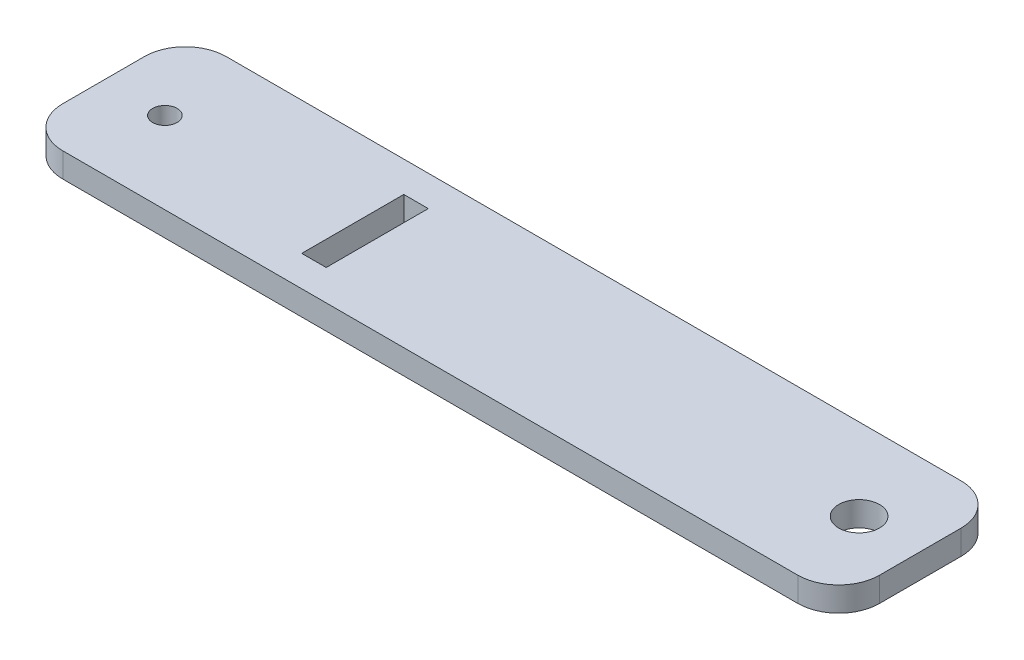
ISO-10303-21;
HEADER;
FILE_DESCRIPTION(('STEP AP214'),'2;1');
FILE_NAME('part.step','',(''),(''),'','','');
FILE_SCHEMA(('AUTOMOTIVE_DESIGN { 1 0 10303 214 1 1 1 1 }'));
ENDSEC;
DATA;
#1=APPLICATION_CONTEXT('core data for automotive mechanical design processes');
#2=APPLICATION_PROTOCOL_DEFINITION('international standard','automotive_design',2000,#1);
#3=PRODUCT_CONTEXT('',#1,'mechanical');
#4=PRODUCT('Part','Part','',(#3));
#5=PRODUCT_RELATED_PRODUCT_CATEGORY('part','',(#4));
#6=PRODUCT_DEFINITION_FORMATION('','',#4);
#7=PRODUCT_DEFINITION_CONTEXT('part definition',#1,'design');
#8=PRODUCT_DEFINITION('design','',#6,#7);
#9=PRODUCT_DEFINITION_SHAPE('','',#8);
#10=(LENGTH_UNIT() NAMED_UNIT(*) SI_UNIT(.MILLI.,.METRE.));
#11=(NAMED_UNIT(*) PLANE_ANGLE_UNIT() SI_UNIT($,.RADIAN.));
#12=(NAMED_UNIT(*) SI_UNIT($,.STERADIAN.) SOLID_ANGLE_UNIT());
#13=UNCERTAINTY_MEASURE_WITH_UNIT(LENGTH_MEASURE(1.E-05),#10,'distance_accuracy_value','');
#14=(GEOMETRIC_REPRESENTATION_CONTEXT(3) GLOBAL_UNCERTAINTY_ASSIGNED_CONTEXT((#13)) GLOBAL_UNIT_ASSIGNED_CONTEXT((#10,
#11,#12)) REPRESENTATION_CONTEXT('',''));
#15=CARTESIAN_POINT('',(0.,0.,0.));
#16=DIRECTION('',(0.,0.,1.));
#17=DIRECTION('',(1.,0.,0.));
#18=AXIS2_PLACEMENT_3D('',#15,#16,#17);
#19=CARTESIAN_POINT('',(90.,6.,9.99999999999998));
#20=DIRECTION('',(0.,1.,0.));
#21=DIRECTION('',(0.,0.,1.));
#22=AXIS2_PLACEMENT_3D('',#19,#20,#21);
#23=PLANE('',#22);
#24=CARTESIAN_POINT('',(85.,6.,0.));
#25=DIRECTION('',(0.,1.,0.));
#26=DIRECTION('',(0.,0.,1.));
#27=AXIS2_PLACEMENT_3D('',#24,#25,#26);
#28=CIRCLE('',#27,5.);
#29=CARTESIAN_POINT('',(85.,6.,5.00000000000001));
#30=VERTEX_POINT('',#29);
#31=EDGE_CURVE('E189',#30,#30,#28,.T.);
#32=ORIENTED_EDGE('',*,*,#31,.F.);
#33=EDGE_LOOP('',(#32));
#34=FACE_BOUND('',#33,.T.);
#35=CARTESIAN_POINT('',(90.,6.,9.99999999999998));
#36=DIRECTION('',(0.,1.,0.));
#37=DIRECTION('',(0.,0.,1.));
#38=AXIS2_PLACEMENT_3D('',#35,#36,#37);
#39=CIRCLE('',#38,10.);
#40=CARTESIAN_POINT('',(90.,6.,20.));
#41=VERTEX_POINT('',#40);
#42=CARTESIAN_POINT('',(100.,6.,9.99999999999998));
#43=VERTEX_POINT('',#42);
#44=EDGE_CURVE('E197',#41,#43,#39,.T.);
#45=ORIENTED_EDGE('',*,*,#44,.T.);
#46=DIRECTION('',(0.,0.,-1.));
#47=VECTOR('',#46,1.);
#48=CARTESIAN_POINT('',(100.,6.,-9.99999999999998));
#49=LINE('',#48,#47);
#50=CARTESIAN_POINT('',(100.,6.,-9.99999999999998));
#51=VERTEX_POINT('',#50);
#52=EDGE_CURVE('E201',#43,#51,#49,.T.);
#53=ORIENTED_EDGE('',*,*,#52,.T.);
#54=CARTESIAN_POINT('',(90.,6.,-9.99999999999998));
#55=DIRECTION('',(0.,1.,0.));
#56=DIRECTION('',(0.,0.,-1.));
#57=AXIS2_PLACEMENT_3D('',#54,#55,#56);
#58=CIRCLE('',#57,10.);
#59=CARTESIAN_POINT('',(90.,6.,-20.));
#60=VERTEX_POINT('',#59);
#61=EDGE_CURVE('E205',#51,#60,#58,.T.);
#62=ORIENTED_EDGE('',*,*,#61,.T.);
#63=DIRECTION('',(-1.,0.,0.));
#64=VECTOR('',#63,1.);
#65=CARTESIAN_POINT('',(-90.,6.,-20.));
#66=LINE('',#65,#64);
#67=CARTESIAN_POINT('',(-90.,6.,-19.9999999999999));
#68=VERTEX_POINT('',#67);
#69=EDGE_CURVE('E208',#60,#68,#66,.T.);
#70=ORIENTED_EDGE('',*,*,#69,.T.);
#71=CARTESIAN_POINT('',(-90.,6.,-9.99999999999997));
#72=DIRECTION('',(0.,1.,0.));
#73=DIRECTION('',(0.,0.,1.));
#74=AXIS2_PLACEMENT_3D('',#71,#72,#73);
#75=CIRCLE('',#74,9.99999999999998);
#76=CARTESIAN_POINT('',(-99.9999999999999,6.,-10.));
#77=VERTEX_POINT('',#76);
#78=EDGE_CURVE('E211',#68,#77,#75,.T.);
#79=ORIENTED_EDGE('',*,*,#78,.T.);
#80=DIRECTION('',(0.,0.,1.));
#81=VECTOR('',#80,1.);
#82=CARTESIAN_POINT('',(-99.9999999999999,6.,-10.));
#83=LINE('',#82,#81);
#84=CARTESIAN_POINT('',(-99.9999999999999,6.,10.));
#85=VERTEX_POINT('',#84);
#86=EDGE_CURVE('E214',#77,#85,#83,.T.);
#87=ORIENTED_EDGE('',*,*,#86,.T.);
#88=CARTESIAN_POINT('',(-90.,6.,10.));
#89=DIRECTION('',(0.,1.,0.));
#90=DIRECTION('',(0.,0.,1.));
#91=AXIS2_PLACEMENT_3D('',#88,#89,#90);
#92=CIRCLE('',#91,9.99999999999998);
#93=CARTESIAN_POINT('',(-90.,6.,20.));
#94=VERTEX_POINT('',#93);
#95=EDGE_CURVE('E217',#85,#94,#92,.T.);
#96=ORIENTED_EDGE('',*,*,#95,.T.);
#97=DIRECTION('',(1.,0.,0.));
#98=VECTOR('',#97,1.);
#99=CARTESIAN_POINT('',(-90.,6.,20.));
#100=LINE('',#99,#98);
#101=EDGE_CURVE('E220',#94,#41,#100,.T.);
#102=ORIENTED_EDGE('',*,*,#101,.T.);
#103=EDGE_LOOP('',(#45,#53,#62,#70,#79,#87,#96,#102));
#104=FACE_BOUND('',#103,.T.);
#105=CARTESIAN_POINT('',(-85.,6.,0.));
#106=DIRECTION('',(0.,1.,0.));
#107=DIRECTION('',(0.,0.,1.));
#108=AXIS2_PLACEMENT_3D('',#105,#106,#107);
#109=CIRCLE('',#108,3.00000000000001);
#110=CARTESIAN_POINT('',(-85.,6.,3.00000000000001));
#111=VERTEX_POINT('',#110);
#112=EDGE_CURVE('E181',#111,#111,#109,.T.);
#113=ORIENTED_EDGE('',*,*,#112,.F.);
#114=EDGE_LOOP('',(#113));
#115=FACE_BOUND('',#114,.T.);
#116=DIRECTION('',(-1.,0.,0.));
#117=VECTOR('',#116,1.);
#118=CARTESIAN_POINT('',(-38.9999999999999,6.,-12.5));
#119=LINE('',#118,#117);
#120=CARTESIAN_POINT('',(-32.9999999999999,6.,-12.5));
#121=VERTEX_POINT('',#120);
#122=CARTESIAN_POINT('',(-38.9999999999999,6.,-12.5));
#123=VERTEX_POINT('',#122);
#124=EDGE_CURVE('E142',#121,#123,#119,.T.);
#125=ORIENTED_EDGE('',*,*,#124,.F.);
#126=DIRECTION('',(0.,0.,-1.));
#127=VECTOR('',#126,1.);
#128=CARTESIAN_POINT('',(-32.9999999999999,6.,-12.5));
#129=LINE('',#128,#127);
#130=CARTESIAN_POINT('',(-32.9999999999999,6.,12.5));
#131=VERTEX_POINT('',#130);
#132=EDGE_CURVE('E133',#131,#121,#129,.T.);
#133=ORIENTED_EDGE('',*,*,#132,.F.);
#134=DIRECTION('',(1.,0.,0.));
#135=VECTOR('',#134,1.);
#136=CARTESIAN_POINT('',(-38.9999999999999,6.,12.5));
#137=LINE('',#136,#135);
#138=CARTESIAN_POINT('',(-39.,6.,12.5));
#139=VERTEX_POINT('',#138);
#140=EDGE_CURVE('E159',#139,#131,#137,.T.);
#141=ORIENTED_EDGE('',*,*,#140,.F.);
#142=DIRECTION('',(0.,0.,1.));
#143=VECTOR('',#142,1.);
#144=CARTESIAN_POINT('',(-38.9999999999999,6.,-12.5));
#145=LINE('',#144,#143);
#146=EDGE_CURVE('E155',#123,#139,#145,.T.);
#147=ORIENTED_EDGE('',*,*,#146,.F.);
#148=EDGE_LOOP('',(#125,#133,#141,#147));
#149=FACE_BOUND('',#148,.T.);
#150=ADVANCED_FACE('F43',(#34,#104,#115,#149),#23,.T.);
#151=CARTESIAN_POINT('',(90.,0.,9.99999999999998));
#152=DIRECTION('',(0.,1.,0.));
#153=DIRECTION('',(0.,0.,1.));
#154=AXIS2_PLACEMENT_3D('',#151,#152,#153);
#155=PLANE('',#154);
#156=CARTESIAN_POINT('',(-85.,0.,0.));
#157=DIRECTION('',(0.,1.,0.));
#158=DIRECTION('',(0.,0.,1.));
#159=AXIS2_PLACEMENT_3D('',#156,#157,#158);
#160=CIRCLE('',#159,3.00000000000001);
#161=CARTESIAN_POINT('',(-85.,0.,3.00000000000001));
#162=VERTEX_POINT('',#161);
#163=EDGE_CURVE('E151',#162,#162,#160,.T.);
#164=ORIENTED_EDGE('',*,*,#163,.T.);
#165=EDGE_LOOP('',(#164));
#166=FACE_BOUND('',#165,.T.);
#167=CARTESIAN_POINT('',(85.,0.,0.));
#168=DIRECTION('',(0.,1.,0.));
#169=DIRECTION('',(0.,0.,1.));
#170=AXIS2_PLACEMENT_3D('',#167,#168,#169);
#171=CIRCLE('',#170,5.);
#172=CARTESIAN_POINT('',(85.,0.,5.00000000000001));
#173=VERTEX_POINT('',#172);
#174=EDGE_CURVE('E185',#173,#173,#171,.T.);
#175=ORIENTED_EDGE('',*,*,#174,.T.);
#176=EDGE_LOOP('',(#175));
#177=FACE_BOUND('',#176,.T.);
#178=CARTESIAN_POINT('',(90.,0.,9.99999999999998));
#179=DIRECTION('',(0.,1.,0.));
#180=DIRECTION('',(0.,0.,1.));
#181=AXIS2_PLACEMENT_3D('',#178,#179,#180);
#182=CIRCLE('',#181,10.);
#183=CARTESIAN_POINT('',(90.,0.,20.));
#184=VERTEX_POINT('',#183);
#185=CARTESIAN_POINT('',(100.,0.,9.99999999999998));
#186=VERTEX_POINT('',#185);
#187=EDGE_CURVE('E193',#184,#186,#182,.T.);
#188=ORIENTED_EDGE('',*,*,#187,.F.);
#189=DIRECTION('',(1.,0.,0.));
#190=VECTOR('',#189,1.);
#191=CARTESIAN_POINT('',(-90.,0.,20.));
#192=LINE('',#191,#190);
#193=CARTESIAN_POINT('',(-90.,0.,20.));
#194=VERTEX_POINT('',#193);
#195=EDGE_CURVE('E202',#194,#184,#192,.T.);
#196=ORIENTED_EDGE('',*,*,#195,.F.);
#197=CARTESIAN_POINT('',(-90.,0.,10.));
#198=DIRECTION('',(0.,1.,0.));
#199=DIRECTION('',(0.,0.,1.));
#200=AXIS2_PLACEMENT_3D('',#197,#198,#199);
#201=CIRCLE('',#200,9.99999999999998);
#202=CARTESIAN_POINT('',(-99.9999999999999,0.,10.));
#203=VERTEX_POINT('',#202);
#204=EDGE_CURVE('E242',#203,#194,#201,.T.);
#205=ORIENTED_EDGE('',*,*,#204,.F.);
#206=DIRECTION('',(0.,0.,1.));
#207=VECTOR('',#206,1.);
#208=CARTESIAN_POINT('',(-99.9999999999999,0.,-10.));
#209=LINE('',#208,#207);
#210=CARTESIAN_POINT('',(-99.9999999999999,0.,-10.));
#211=VERTEX_POINT('',#210);
#212=EDGE_CURVE('E239',#211,#203,#209,.T.);
#213=ORIENTED_EDGE('',*,*,#212,.F.);
#214=CARTESIAN_POINT('',(-90.,0.,-9.99999999999997));
#215=DIRECTION('',(0.,1.,0.));
#216=DIRECTION('',(0.,0.,1.));
#217=AXIS2_PLACEMENT_3D('',#214,#215,#216);
#218=CIRCLE('',#217,9.99999999999998);
#219=CARTESIAN_POINT('',(-90.,0.,-19.9999999999999));
#220=VERTEX_POINT('',#219);
#221=EDGE_CURVE('E236',#220,#211,#218,.T.);
#222=ORIENTED_EDGE('',*,*,#221,.F.);
#223=DIRECTION('',(-1.,0.,0.));
#224=VECTOR('',#223,1.);
#225=CARTESIAN_POINT('',(-90.,0.,-20.));
#226=LINE('',#225,#224);
#227=CARTESIAN_POINT('',(90.,0.,-20.));
#228=VERTEX_POINT('',#227);
#229=EDGE_CURVE('E233',#228,#220,#226,.T.);
#230=ORIENTED_EDGE('',*,*,#229,.F.);
#231=CARTESIAN_POINT('',(90.,0.,-9.99999999999998));
#232=DIRECTION('',(0.,1.,0.));
#233=DIRECTION('',(0.,0.,-1.));
#234=AXIS2_PLACEMENT_3D('',#231,#232,#233);
#235=CIRCLE('',#234,10.);
#236=CARTESIAN_POINT('',(100.,0.,-9.99999999999998));
#237=VERTEX_POINT('',#236);
#238=EDGE_CURVE('E230',#237,#228,#235,.T.);
#239=ORIENTED_EDGE('',*,*,#238,.F.);
#240=DIRECTION('',(0.,0.,-1.));
#241=VECTOR('',#240,1.);
#242=CARTESIAN_POINT('',(100.,0.,-9.99999999999998));
#243=LINE('',#242,#241);
#244=EDGE_CURVE('E227',#186,#237,#243,.T.);
#245=ORIENTED_EDGE('',*,*,#244,.F.);
#246=EDGE_LOOP('',(#188,#196,#205,#213,#222,#230,#239,#245));
#247=FACE_BOUND('',#246,.T.);
#248=DIRECTION('',(0.,0.,-1.));
#249=VECTOR('',#248,1.);
#250=CARTESIAN_POINT('',(-32.9999999999999,0.,-12.5));
#251=LINE('',#250,#249);
#252=CARTESIAN_POINT('',(-32.9999999999999,0.,12.5));
#253=VERTEX_POINT('',#252);
#254=CARTESIAN_POINT('',(-32.9999999999999,0.,-12.5));
#255=VERTEX_POINT('',#254);
#256=EDGE_CURVE('E67',#253,#255,#251,.T.);
#257=ORIENTED_EDGE('',*,*,#256,.T.);
#258=DIRECTION('',(-1.,0.,0.));
#259=VECTOR('',#258,1.);
#260=CARTESIAN_POINT('',(-38.9999999999999,0.,-12.5));
#261=LINE('',#260,#259);
#262=CARTESIAN_POINT('',(-38.9999999999999,0.,-12.5));
#263=VERTEX_POINT('',#262);
#264=EDGE_CURVE('E149',#255,#263,#261,.T.);
#265=ORIENTED_EDGE('',*,*,#264,.T.);
#266=DIRECTION('',(0.,0.,1.));
#267=VECTOR('',#266,1.);
#268=CARTESIAN_POINT('',(-38.9999999999999,0.,-12.5));
#269=LINE('',#268,#267);
#270=CARTESIAN_POINT('',(-38.9999999999999,0.,12.5));
#271=VERTEX_POINT('',#270);
#272=EDGE_CURVE('E168',#263,#271,#269,.T.);
#273=ORIENTED_EDGE('',*,*,#272,.T.);
#274=DIRECTION('',(1.,0.,0.));
#275=VECTOR('',#274,1.);
#276=CARTESIAN_POINT('',(-38.9999999999999,0.,12.5));
#277=LINE('',#276,#275);
#278=EDGE_CURVE('E143',#271,#253,#277,.T.);
#279=ORIENTED_EDGE('',*,*,#278,.T.);
#280=EDGE_LOOP('',(#257,#265,#273,#279));
#281=FACE_BOUND('',#280,.T.);
#282=ADVANCED_FACE('F281',(#166,#177,#247,#281),#155,.F.);
#283=CARTESIAN_POINT('',(90.,6.,9.99999999999998));
#284=DIRECTION('',(0.,-1.,0.));
#285=DIRECTION('',(0.,0.,-1.));
#286=AXIS2_PLACEMENT_3D('',#283,#284,#285);
#287=CYLINDRICAL_SURFACE('',#286,10.);
#288=ORIENTED_EDGE('',*,*,#187,.T.);
#289=DIRECTION('',(0.,-1.,0.));
#290=VECTOR('',#289,1.);
#291=CARTESIAN_POINT('',(100.,6.,9.99999999999998));
#292=LINE('',#291,#290);
#293=EDGE_CURVE('E11',#43,#186,#292,.T.);
#294=ORIENTED_EDGE('',*,*,#293,.F.);
#295=ORIENTED_EDGE('',*,*,#44,.F.);
#296=DIRECTION('',(0.,-1.,0.));
#297=VECTOR('',#296,1.);
#298=CARTESIAN_POINT('',(90.,6.,20.));
#299=LINE('',#298,#297);
#300=EDGE_CURVE('E223',#41,#184,#299,.T.);
#301=ORIENTED_EDGE('',*,*,#300,.T.);
#302=EDGE_LOOP('',(#288,#294,#295,#301));
#303=FACE_BOUND('',#302,.T.);
#304=ADVANCED_FACE('F45',(#303),#287,.T.);
#305=CARTESIAN_POINT('',(100.,6.,-9.99999999999998));
#306=DIRECTION('',(-1.,0.,0.));
#307=DIRECTION('',(0.,0.,1.));
#308=AXIS2_PLACEMENT_3D('',#305,#306,#307);
#309=PLANE('',#308);
#310=ORIENTED_EDGE('',*,*,#244,.T.);
#311=DIRECTION('',(0.,-1.,0.));
#312=VECTOR('',#311,1.);
#313=CARTESIAN_POINT('',(100.,6.,-9.99999999999998));
#314=LINE('',#313,#312);
#315=EDGE_CURVE('E52',#51,#237,#314,.T.);
#316=ORIENTED_EDGE('',*,*,#315,.F.);
#317=ORIENTED_EDGE('',*,*,#52,.F.);
#318=ORIENTED_EDGE('',*,*,#293,.T.);
#319=EDGE_LOOP('',(#310,#316,#317,#318));
#320=FACE_BOUND('',#319,.T.);
#321=ADVANCED_FACE('F299',(#320),#309,.F.);
#322=CARTESIAN_POINT('',(90.,6.,-9.99999999999998));
#323=DIRECTION('',(0.,-1.,0.));
#324=DIRECTION('',(0.,0.,-1.));
#325=AXIS2_PLACEMENT_3D('',#322,#323,#324);
#326=CYLINDRICAL_SURFACE('',#325,10.);
#327=ORIENTED_EDGE('',*,*,#238,.T.);
#328=DIRECTION('',(0.,-1.,0.));
#329=VECTOR('',#328,1.);
#330=CARTESIAN_POINT('',(90.,6.,-20.));
#331=LINE('',#330,#329);
#332=EDGE_CURVE('E266',#60,#228,#331,.T.);
#333=ORIENTED_EDGE('',*,*,#332,.F.);
#334=ORIENTED_EDGE('',*,*,#61,.F.);
#335=ORIENTED_EDGE('',*,*,#315,.T.);
#336=EDGE_LOOP('',(#327,#333,#334,#335));
#337=FACE_BOUND('',#336,.T.);
#338=ADVANCED_FACE('F275',(#337),#326,.T.);
#339=CARTESIAN_POINT('',(-90.,6.,-20.));
#340=DIRECTION('',(0.,0.,1.));
#341=DIRECTION('',(1.,0.,0.));
#342=AXIS2_PLACEMENT_3D('',#339,#340,#341);
#343=PLANE('',#342);
#344=ORIENTED_EDGE('',*,*,#229,.T.);
#345=DIRECTION('',(0.,-1.,0.));
#346=VECTOR('',#345,1.);
#347=CARTESIAN_POINT('',(-90.,6.,-19.9999999999999));
#348=LINE('',#347,#346);
#349=EDGE_CURVE('E262',#68,#220,#348,.T.);
#350=ORIENTED_EDGE('',*,*,#349,.F.);
#351=ORIENTED_EDGE('',*,*,#69,.F.);
#352=ORIENTED_EDGE('',*,*,#332,.T.);
#353=EDGE_LOOP('',(#344,#350,#351,#352));
#354=FACE_BOUND('',#353,.T.);
#355=ADVANCED_FACE('F287',(#354),#343,.F.);
#356=CARTESIAN_POINT('',(-90.,6.,-9.99999999999997));
#357=DIRECTION('',(0.,-1.,0.));
#358=DIRECTION('',(0.,0.,-1.));
#359=AXIS2_PLACEMENT_3D('',#356,#357,#358);
#360=CYLINDRICAL_SURFACE('',#359,9.99999999999998);
#361=ORIENTED_EDGE('',*,*,#221,.T.);
#362=DIRECTION('',(0.,-1.,0.));
#363=VECTOR('',#362,1.);
#364=CARTESIAN_POINT('',(-99.9999999999999,6.,-10.));
#365=LINE('',#364,#363);
#366=EDGE_CURVE('E258',#77,#211,#365,.T.);
#367=ORIENTED_EDGE('',*,*,#366,.F.);
#368=ORIENTED_EDGE('',*,*,#78,.F.);
#369=ORIENTED_EDGE('',*,*,#349,.T.);
#370=EDGE_LOOP('',(#361,#367,#368,#369));
#371=FACE_BOUND('',#370,.T.);
#372=ADVANCED_FACE('F291',(#371),#360,.T.);
#373=CARTESIAN_POINT('',(-99.9999999999999,6.,-10.));
#374=DIRECTION('',(1.,0.,0.));
#375=DIRECTION('',(0.,0.,-1.));
#376=AXIS2_PLACEMENT_3D('',#373,#374,#375);
#377=PLANE('',#376);
#378=ORIENTED_EDGE('',*,*,#212,.T.);
#379=DIRECTION('',(0.,-1.,0.));
#380=VECTOR('',#379,1.);
#381=CARTESIAN_POINT('',(-99.9999999999999,6.,10.));
#382=LINE('',#381,#380);
#383=EDGE_CURVE('E254',#85,#203,#382,.T.);
#384=ORIENTED_EDGE('',*,*,#383,.F.);
#385=ORIENTED_EDGE('',*,*,#86,.F.);
#386=ORIENTED_EDGE('',*,*,#366,.T.);
#387=EDGE_LOOP('',(#378,#384,#385,#386));
#388=FACE_BOUND('',#387,.T.);
#389=ADVANCED_FACE('F312',(#388),#377,.F.);
#390=CARTESIAN_POINT('',(-90.,6.,10.));
#391=DIRECTION('',(0.,-1.,0.));
#392=DIRECTION('',(0.,0.,-1.));
#393=AXIS2_PLACEMENT_3D('',#390,#391,#392);
#394=CYLINDRICAL_SURFACE('',#393,9.99999999999998);
#395=ORIENTED_EDGE('',*,*,#204,.T.);
#396=DIRECTION('',(0.,-1.,0.));
#397=VECTOR('',#396,1.);
#398=CARTESIAN_POINT('',(-90.,6.,20.));
#399=LINE('',#398,#397);
#400=EDGE_CURVE('E250',#94,#194,#399,.T.);
#401=ORIENTED_EDGE('',*,*,#400,.F.);
#402=ORIENTED_EDGE('',*,*,#95,.F.);
#403=ORIENTED_EDGE('',*,*,#383,.T.);
#404=EDGE_LOOP('',(#395,#401,#402,#403));
#405=FACE_BOUND('',#404,.T.);
#406=ADVANCED_FACE('F310',(#405),#394,.T.);
#407=CARTESIAN_POINT('',(-90.,6.,20.));
#408=DIRECTION('',(0.,0.,-1.));
#409=DIRECTION('',(-1.,0.,0.));
#410=AXIS2_PLACEMENT_3D('',#407,#408,#409);
#411=PLANE('',#410);
#412=ORIENTED_EDGE('',*,*,#195,.T.);
#413=ORIENTED_EDGE('',*,*,#300,.F.);
#414=ORIENTED_EDGE('',*,*,#101,.F.);
#415=ORIENTED_EDGE('',*,*,#400,.T.);
#416=EDGE_LOOP('',(#412,#413,#414,#415));
#417=FACE_BOUND('',#416,.T.);
#418=ADVANCED_FACE('F305',(#417),#411,.F.);
#419=CARTESIAN_POINT('',(85.,6.,0.));
#420=DIRECTION('',(0.,-1.,0.));
#421=DIRECTION('',(0.,0.,-1.));
#422=AXIS2_PLACEMENT_3D('',#419,#420,#421);
#423=CYLINDRICAL_SURFACE('',#422,5.);
#424=ORIENTED_EDGE('',*,*,#31,.T.);
#425=EDGE_LOOP('',(#424));
#426=FACE_BOUND('',#425,.T.);
#427=ORIENTED_EDGE('',*,*,#174,.F.);
#428=EDGE_LOOP('',(#427));
#429=FACE_BOUND('',#428,.T.);
#430=ADVANCED_FACE('F331',(#426,#429),#423,.F.);
#431=CARTESIAN_POINT('',(-85.,6.,0.));
#432=DIRECTION('',(0.,-1.,0.));
#433=DIRECTION('',(0.,0.,-1.));
#434=AXIS2_PLACEMENT_3D('',#431,#432,#433);
#435=CYLINDRICAL_SURFACE('',#434,3.00000000000001);
#436=ORIENTED_EDGE('',*,*,#112,.T.);
#437=EDGE_LOOP('',(#436));
#438=FACE_BOUND('',#437,.T.);
#439=ORIENTED_EDGE('',*,*,#163,.F.);
#440=EDGE_LOOP('',(#439));
#441=FACE_BOUND('',#440,.T.);
#442=ADVANCED_FACE('F338',(#438,#441),#435,.F.);
#443=CARTESIAN_POINT('',(-32.9999999999999,6.,-12.5));
#444=DIRECTION('',(-1.,0.,0.));
#445=DIRECTION('',(0.,0.,1.));
#446=AXIS2_PLACEMENT_3D('',#443,#444,#445);
#447=PLANE('',#446);
#448=ORIENTED_EDGE('',*,*,#256,.F.);
#449=DIRECTION('',(0.,-1.,0.));
#450=VECTOR('',#449,1.);
#451=CARTESIAN_POINT('',(-32.9999999999999,6.,12.5));
#452=LINE('',#451,#450);
#453=EDGE_CURVE('E137',#131,#253,#452,.T.);
#454=ORIENTED_EDGE('',*,*,#453,.F.);
#455=ORIENTED_EDGE('',*,*,#132,.T.);
#456=DIRECTION('',(0.,-1.,0.));
#457=VECTOR('',#456,1.);
#458=CARTESIAN_POINT('',(-32.9999999999999,6.,-12.5));
#459=LINE('',#458,#457);
#460=EDGE_CURVE('E136',#121,#255,#459,.T.);
#461=ORIENTED_EDGE('',*,*,#460,.T.);
#462=EDGE_LOOP('',(#448,#454,#455,#461));
#463=FACE_BOUND('',#462,.T.);
#464=ADVANCED_FACE('F135',(#463),#447,.T.);
#465=CARTESIAN_POINT('',(-38.9999999999999,6.,-12.5));
#466=DIRECTION('',(0.,0.,1.));
#467=DIRECTION('',(1.,0.,0.));
#468=AXIS2_PLACEMENT_3D('',#465,#466,#467);
#469=PLANE('',#468);
#470=ORIENTED_EDGE('',*,*,#264,.F.);
#471=ORIENTED_EDGE('',*,*,#460,.F.);
#472=ORIENTED_EDGE('',*,*,#124,.T.);
#473=DIRECTION('',(0.,-1.,0.));
#474=VECTOR('',#473,1.);
#475=CARTESIAN_POINT('',(-38.9999999999999,6.,-12.5));
#476=LINE('',#475,#474);
#477=EDGE_CURVE('E152',#123,#263,#476,.T.);
#478=ORIENTED_EDGE('',*,*,#477,.T.);
#479=EDGE_LOOP('',(#470,#471,#472,#478));
#480=FACE_BOUND('',#479,.T.);
#481=ADVANCED_FACE('F146',(#480),#469,.T.);
#482=CARTESIAN_POINT('',(-38.9999999999999,6.,-12.5));
#483=DIRECTION('',(1.,0.,0.));
#484=DIRECTION('',(0.,0.,-1.));
#485=AXIS2_PLACEMENT_3D('',#482,#483,#484);
#486=PLANE('',#485);
#487=ORIENTED_EDGE('',*,*,#272,.F.);
#488=ORIENTED_EDGE('',*,*,#477,.F.);
#489=ORIENTED_EDGE('',*,*,#146,.T.);
#490=DIRECTION('',(0.,-1.,0.));
#491=VECTOR('',#490,1.);
#492=CARTESIAN_POINT('',(-38.9999999999999,6.,12.5));
#493=LINE('',#492,#491);
#494=EDGE_CURVE('E59',#139,#271,#493,.T.);
#495=ORIENTED_EDGE('',*,*,#494,.T.);
#496=EDGE_LOOP('',(#487,#488,#489,#495));
#497=FACE_BOUND('',#496,.T.);
#498=ADVANCED_FACE('F355',(#497),#486,.T.);
#499=CARTESIAN_POINT('',(-38.9999999999999,6.,12.5));
#500=DIRECTION('',(0.,0.,-1.));
#501=DIRECTION('',(-1.,0.,0.));
#502=AXIS2_PLACEMENT_3D('',#499,#500,#501);
#503=PLANE('',#502);
#504=ORIENTED_EDGE('',*,*,#278,.F.);
#505=ORIENTED_EDGE('',*,*,#494,.F.);
#506=ORIENTED_EDGE('',*,*,#140,.T.);
#507=ORIENTED_EDGE('',*,*,#453,.T.);
#508=EDGE_LOOP('',(#504,#505,#506,#507));
#509=FACE_BOUND('',#508,.T.);
#510=ADVANCED_FACE('F358',(#509),#503,.T.);
#511=CLOSED_SHELL('',(#150,#282,#304,#321,#338,#355,#372,#389,#406,#418,#430,#442,#464,#481,
#498,#510));
#512=MANIFOLD_SOLID_BREP('B2',#511);
#513=ADVANCED_BREP_SHAPE_REPRESENTATION('',(#18,#512),#14);
#514=SHAPE_DEFINITION_REPRESENTATION(#9,#513);
ENDSEC;
END-ISO-10303-21;
